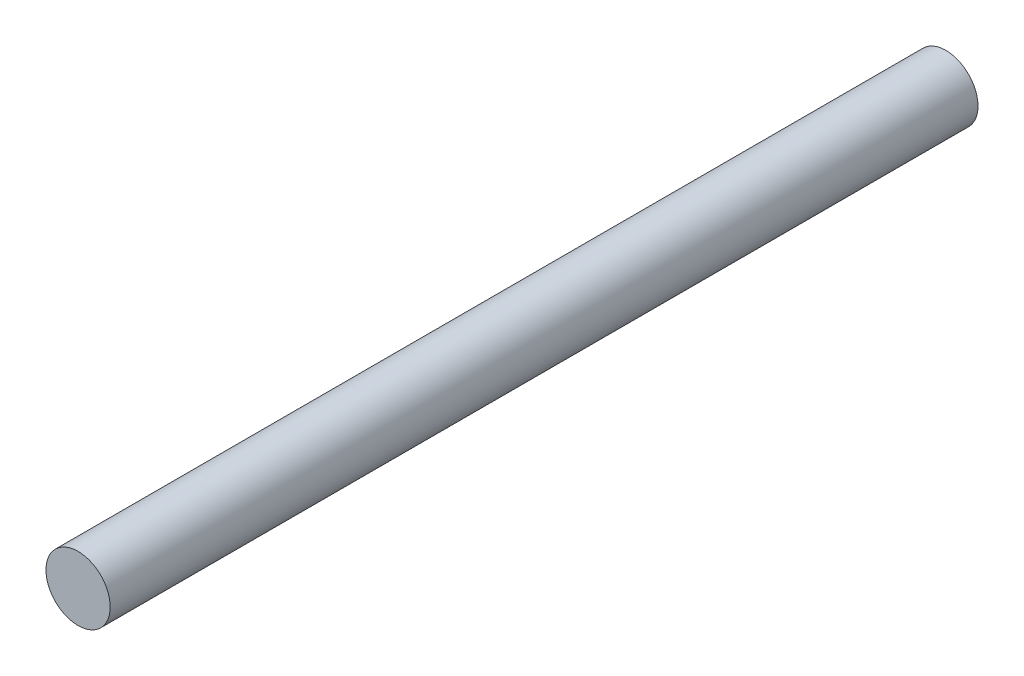
ISO-10303-21;
HEADER;
FILE_DESCRIPTION(('STEP AP214'),'2;1');
FILE_NAME('part.step','',(''),(''),'','','');
FILE_SCHEMA(('AUTOMOTIVE_DESIGN { 1 0 10303 214 1 1 1 1 }'));
ENDSEC;
DATA;
#1=APPLICATION_CONTEXT('core data for automotive mechanical design processes');
#2=APPLICATION_PROTOCOL_DEFINITION('international standard','automotive_design',2000,#1);
#3=PRODUCT_CONTEXT('',#1,'mechanical');
#4=PRODUCT('Part','Part','',(#3));
#5=PRODUCT_RELATED_PRODUCT_CATEGORY('part','',(#4));
#6=PRODUCT_DEFINITION_FORMATION('','',#4);
#7=PRODUCT_DEFINITION_CONTEXT('part definition',#1,'design');
#8=PRODUCT_DEFINITION('design','',#6,#7);
#9=PRODUCT_DEFINITION_SHAPE('','',#8);
#10=(LENGTH_UNIT() NAMED_UNIT(*) SI_UNIT(.MILLI.,.METRE.));
#11=(NAMED_UNIT(*) PLANE_ANGLE_UNIT() SI_UNIT($,.RADIAN.));
#12=(NAMED_UNIT(*) SI_UNIT($,.STERADIAN.) SOLID_ANGLE_UNIT());
#13=UNCERTAINTY_MEASURE_WITH_UNIT(LENGTH_MEASURE(1.E-05),#10,'distance_accuracy_value','');
#14=(GEOMETRIC_REPRESENTATION_CONTEXT(3) GLOBAL_UNCERTAINTY_ASSIGNED_CONTEXT((#13)) GLOBAL_UNIT_ASSIGNED_CONTEXT((#10,
#11,#12)) REPRESENTATION_CONTEXT('',''));
#15=CARTESIAN_POINT('',(0.,0.,0.));
#16=DIRECTION('',(0.,0.,1.));
#17=DIRECTION('',(1.,0.,0.));
#18=AXIS2_PLACEMENT_3D('',#15,#16,#17);
#19=CARTESIAN_POINT('',(0.,0.,270.));
#20=DIRECTION('',(0.,0.,-1.));
#21=DIRECTION('',(-1.,0.,0.));
#22=AXIS2_PLACEMENT_3D('',#19,#20,#21);
#23=CYLINDRICAL_SURFACE('',#22,10.);
#24=CARTESIAN_POINT('',(0.,0.,270.));
#25=DIRECTION('',(0.,0.,1.));
#26=DIRECTION('',(1.,0.,0.));
#27=AXIS2_PLACEMENT_3D('',#24,#25,#26);
#28=CIRCLE('',#27,10.);
#29=CARTESIAN_POINT('',(10.,0.,270.));
#30=VERTEX_POINT('',#29);
#31=EDGE_CURVE('E10',#30,#30,#28,.T.);
#32=ORIENTED_EDGE('',*,*,#31,.F.);
#33=EDGE_LOOP('',(#32));
#34=FACE_BOUND('',#33,.T.);
#35=CARTESIAN_POINT('',(0.,0.,0.));
#36=DIRECTION('',(0.,0.,1.));
#37=DIRECTION('',(1.,0.,0.));
#38=AXIS2_PLACEMENT_3D('',#35,#36,#37);
#39=CIRCLE('',#38,10.);
#40=CARTESIAN_POINT('',(10.,0.,0.));
#41=VERTEX_POINT('',#40);
#42=EDGE_CURVE('E34',#41,#41,#39,.T.);
#43=ORIENTED_EDGE('',*,*,#42,.T.);
#44=EDGE_LOOP('',(#43));
#45=FACE_BOUND('',#44,.T.);
#46=ADVANCED_FACE('F31',(#34,#45),#23,.T.);
#47=CARTESIAN_POINT('',(0.,0.,270.));
#48=DIRECTION('',(0.,0.,1.));
#49=DIRECTION('',(1.,0.,0.));
#50=AXIS2_PLACEMENT_3D('',#47,#48,#49);
#51=PLANE('',#50);
#52=ORIENTED_EDGE('',*,*,#31,.T.);
#53=EDGE_LOOP('',(#52));
#54=FACE_BOUND('',#53,.T.);
#55=ADVANCED_FACE('F46',(#54),#51,.T.);
#56=CARTESIAN_POINT('',(0.,0.,0.));
#57=DIRECTION('',(0.,0.,1.));
#58=DIRECTION('',(1.,0.,0.));
#59=AXIS2_PLACEMENT_3D('',#56,#57,#58);
#60=PLANE('',#59);
#61=ORIENTED_EDGE('',*,*,#42,.F.);
#62=EDGE_LOOP('',(#61));
#63=FACE_BOUND('',#62,.T.);
#64=ADVANCED_FACE('F44',(#63),#60,.F.);
#65=CLOSED_SHELL('',(#46,#55,#64));
#66=MANIFOLD_SOLID_BREP('B2',#65);
#67=ADVANCED_BREP_SHAPE_REPRESENTATION('',(#18,#66),#14);
#68=SHAPE_DEFINITION_REPRESENTATION(#9,#67);
ENDSEC;
END-ISO-10303-21;
